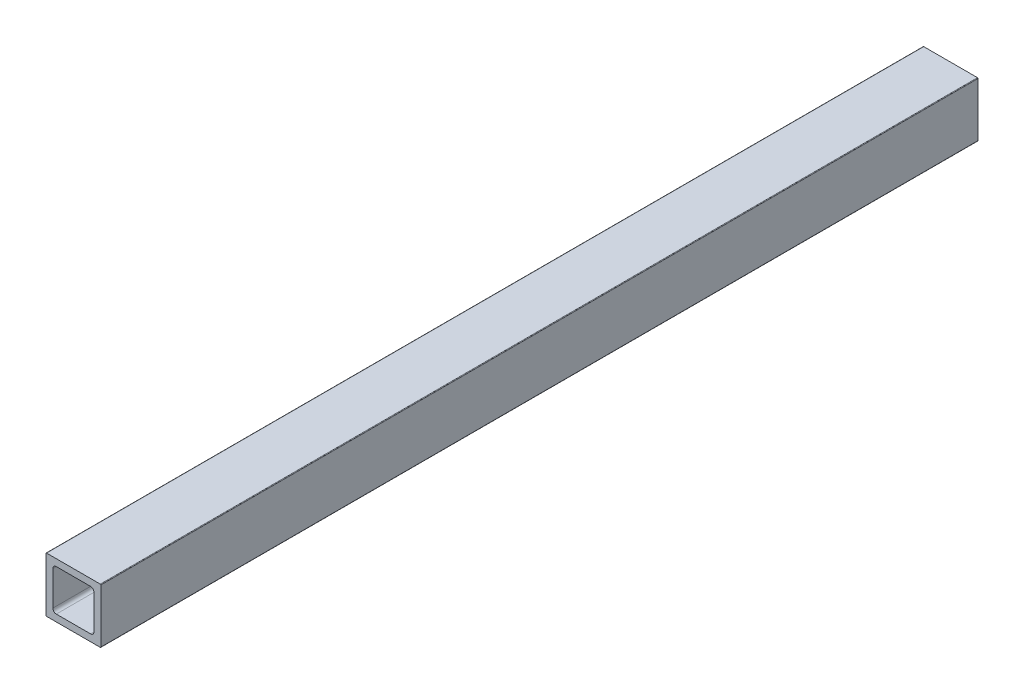
ISO-10303-21;
HEADER;
FILE_DESCRIPTION(('STEP AP214'),'2;1');
FILE_NAME('part.step','',(''),(''),'','','');
FILE_SCHEMA(('AUTOMOTIVE_DESIGN { 1 0 10303 214 1 1 1 1 }'));
ENDSEC;
DATA;
#1=APPLICATION_CONTEXT('core data for automotive mechanical design processes');
#2=APPLICATION_PROTOCOL_DEFINITION('international standard','automotive_design',2000,#1);
#3=PRODUCT_CONTEXT('',#1,'mechanical');
#4=PRODUCT('Part','Part','',(#3));
#5=PRODUCT_RELATED_PRODUCT_CATEGORY('part','',(#4));
#6=PRODUCT_DEFINITION_FORMATION('','',#4);
#7=PRODUCT_DEFINITION_CONTEXT('part definition',#1,'design');
#8=PRODUCT_DEFINITION('design','',#6,#7);
#9=PRODUCT_DEFINITION_SHAPE('','',#8);
#10=(LENGTH_UNIT() NAMED_UNIT(*) SI_UNIT(.MILLI.,.METRE.));
#11=(NAMED_UNIT(*) PLANE_ANGLE_UNIT() SI_UNIT($,.RADIAN.));
#12=(NAMED_UNIT(*) SI_UNIT($,.STERADIAN.) SOLID_ANGLE_UNIT());
#13=UNCERTAINTY_MEASURE_WITH_UNIT(LENGTH_MEASURE(1.E-05),#10,'distance_accuracy_value','');
#14=(GEOMETRIC_REPRESENTATION_CONTEXT(3) GLOBAL_UNCERTAINTY_ASSIGNED_CONTEXT((#13)) GLOBAL_UNIT_ASSIGNED_CONTEXT((#10,
#11,#12)) REPRESENTATION_CONTEXT('',''));
#15=CARTESIAN_POINT('',(0.,0.,0.));
#16=DIRECTION('',(0.,0.,1.));
#17=DIRECTION('',(1.,0.,0.));
#18=AXIS2_PLACEMENT_3D('',#15,#16,#17);
#19=CARTESIAN_POINT('',(3.175,4.7625,1828.8));
#20=DIRECTION('',(1.,0.,0.));
#21=DIRECTION('',(0.,1.,0.));
#22=AXIS2_PLACEMENT_3D('',#19,#20,#21);
#23=PLANE('',#22);
#24=DIRECTION('',(0.,-1.,0.));
#25=VECTOR('',#24,1.);
#26=CARTESIAN_POINT('',(3.175,4.7625,1422.4));
#27=LINE('',#26,#25);
#28=CARTESIAN_POINT('',(3.175,20.6375,1422.4));
#29=VERTEX_POINT('',#28);
#30=CARTESIAN_POINT('',(3.175,4.7625,1422.4));
#31=VERTEX_POINT('',#30);
#32=EDGE_CURVE('E55',#29,#31,#27,.T.);
#33=ORIENTED_EDGE('',*,*,#32,.F.);
#34=DIRECTION('',(0.,0.,-1.));
#35=VECTOR('',#34,1.);
#36=CARTESIAN_POINT('',(3.175,20.6375,1828.8));
#37=LINE('',#36,#35);
#38=CARTESIAN_POINT('',(3.175,20.6375,1828.8));
#39=VERTEX_POINT('',#38);
#40=EDGE_CURVE('E48',#39,#29,#37,.T.);
#41=ORIENTED_EDGE('',*,*,#40,.F.);
#42=DIRECTION('',(0.,-1.,0.));
#43=VECTOR('',#42,1.);
#44=CARTESIAN_POINT('',(3.175,4.7625,1828.8));
#45=LINE('',#44,#43);
#46=CARTESIAN_POINT('',(3.175,4.7625,1828.8));
#47=VERTEX_POINT('',#46);
#48=EDGE_CURVE('E214',#39,#47,#45,.T.);
#49=ORIENTED_EDGE('',*,*,#48,.T.);
#50=DIRECTION('',(0.,0.,-1.));
#51=VECTOR('',#50,1.);
#52=CARTESIAN_POINT('',(3.175,4.7625,1828.8));
#53=LINE('',#52,#51);
#54=EDGE_CURVE('E319',#47,#31,#53,.T.);
#55=ORIENTED_EDGE('',*,*,#54,.T.);
#56=EDGE_LOOP('',(#33,#41,#49,#55));
#57=FACE_BOUND('',#56,.T.);
#58=ADVANCED_FACE('F40',(#57),#23,.T.);
#59=CARTESIAN_POINT('',(4.7625,20.6375,1828.8));
#60=DIRECTION('',(0.,0.,-1.));
#61=DIRECTION('',(-1.,0.,0.));
#62=AXIS2_PLACEMENT_3D('',#59,#60,#61);
#63=CYLINDRICAL_SURFACE('',#62,1.5875);
#64=ORIENTED_EDGE('',*,*,#40,.T.);
#65=CARTESIAN_POINT('',(4.7625,20.6375,1422.4));
#66=DIRECTION('',(0.,0.,1.));
#67=DIRECTION('',(1.,0.,0.));
#68=AXIS2_PLACEMENT_3D('',#65,#66,#67);
#69=CIRCLE('',#68,1.5875);
#70=CARTESIAN_POINT('',(4.7625,22.225,1422.4));
#71=VERTEX_POINT('',#70);
#72=EDGE_CURVE('E299',#29,#71,#69,.F.);
#73=ORIENTED_EDGE('',*,*,#72,.T.);
#74=DIRECTION('',(0.,0.,-1.));
#75=VECTOR('',#74,1.);
#76=CARTESIAN_POINT('',(4.7625,22.225,1828.8));
#77=LINE('',#76,#75);
#78=CARTESIAN_POINT('',(4.7625,22.225,1828.8));
#79=VERTEX_POINT('',#78);
#80=EDGE_CURVE('E287',#79,#71,#77,.T.);
#81=ORIENTED_EDGE('',*,*,#80,.F.);
#82=CARTESIAN_POINT('',(4.7625,20.6375,1828.8));
#83=DIRECTION('',(0.,0.,1.));
#84=DIRECTION('',(-1.,0.,0.));
#85=AXIS2_PLACEMENT_3D('',#82,#83,#84);
#86=CIRCLE('',#85,1.5875);
#87=EDGE_CURVE('E219',#79,#39,#86,.T.);
#88=ORIENTED_EDGE('',*,*,#87,.T.);
#89=EDGE_LOOP('',(#64,#73,#81,#88));
#90=FACE_BOUND('',#89,.T.);
#91=ADVANCED_FACE('F297',(#90),#63,.F.);
#92=CARTESIAN_POINT('',(4.7625,22.225,1828.8));
#93=DIRECTION('',(0.,-1.,0.));
#94=DIRECTION('',(0.,0.,-1.));
#95=AXIS2_PLACEMENT_3D('',#92,#93,#94);
#96=PLANE('',#95);
#97=DIRECTION('',(-1.,0.,0.));
#98=VECTOR('',#97,1.);
#99=CARTESIAN_POINT('',(4.7625,22.225,1422.4));
#100=LINE('',#99,#98);
#101=CARTESIAN_POINT('',(20.6375,22.225,1422.4));
#102=VERTEX_POINT('',#101);
#103=EDGE_CURVE('E332',#102,#71,#100,.T.);
#104=ORIENTED_EDGE('',*,*,#103,.F.);
#105=DIRECTION('',(0.,0.,-1.));
#106=VECTOR('',#105,1.);
#107=CARTESIAN_POINT('',(20.6375,22.225,1828.8));
#108=LINE('',#107,#106);
#109=CARTESIAN_POINT('',(20.6375,22.225,1828.8));
#110=VERTEX_POINT('',#109);
#111=EDGE_CURVE('E234',#110,#102,#108,.T.);
#112=ORIENTED_EDGE('',*,*,#111,.F.);
#113=DIRECTION('',(-1.,0.,0.));
#114=VECTOR('',#113,1.);
#115=CARTESIAN_POINT('',(4.7625,22.225,1828.8));
#116=LINE('',#115,#114);
#117=EDGE_CURVE('E223',#110,#79,#116,.T.);
#118=ORIENTED_EDGE('',*,*,#117,.T.);
#119=ORIENTED_EDGE('',*,*,#80,.T.);
#120=EDGE_LOOP('',(#104,#112,#118,#119));
#121=FACE_BOUND('',#120,.T.);
#122=ADVANCED_FACE('F286',(#121),#96,.T.);
#123=CARTESIAN_POINT('',(20.6375,20.6375,1828.8));
#124=DIRECTION('',(0.,0.,-1.));
#125=DIRECTION('',(-1.,0.,0.));
#126=AXIS2_PLACEMENT_3D('',#123,#124,#125);
#127=CYLINDRICAL_SURFACE('',#126,1.5875);
#128=ORIENTED_EDGE('',*,*,#111,.T.);
#129=CARTESIAN_POINT('',(20.6375,20.6375,1422.4));
#130=DIRECTION('',(0.,0.,1.));
#131=DIRECTION('',(1.,0.,0.));
#132=AXIS2_PLACEMENT_3D('',#129,#130,#131);
#133=CIRCLE('',#132,1.5875);
#134=CARTESIAN_POINT('',(22.225,20.6375,1422.4));
#135=VERTEX_POINT('',#134);
#136=EDGE_CURVE('E334',#102,#135,#133,.F.);
#137=ORIENTED_EDGE('',*,*,#136,.T.);
#138=DIRECTION('',(0.,0.,-1.));
#139=VECTOR('',#138,1.);
#140=CARTESIAN_POINT('',(22.225,20.6375,1828.8));
#141=LINE('',#140,#139);
#142=CARTESIAN_POINT('',(22.225,20.6375,1828.8));
#143=VERTEX_POINT('',#142);
#144=EDGE_CURVE('E230',#143,#135,#141,.T.);
#145=ORIENTED_EDGE('',*,*,#144,.F.);
#146=CARTESIAN_POINT('',(20.6375,20.6375,1828.8));
#147=DIRECTION('',(0.,0.,1.));
#148=DIRECTION('',(-1.,0.,0.));
#149=AXIS2_PLACEMENT_3D('',#146,#147,#148);
#150=CIRCLE('',#149,1.5875);
#151=EDGE_CURVE('E209',#143,#110,#150,.T.);
#152=ORIENTED_EDGE('',*,*,#151,.T.);
#153=EDGE_LOOP('',(#128,#137,#145,#152));
#154=FACE_BOUND('',#153,.T.);
#155=ADVANCED_FACE('F489',(#154),#127,.F.);
#156=CARTESIAN_POINT('',(22.225,4.7625,1828.8));
#157=DIRECTION('',(-1.,0.,0.));
#158=DIRECTION('',(0.,0.,1.));
#159=AXIS2_PLACEMENT_3D('',#156,#157,#158);
#160=PLANE('',#159);
#161=DIRECTION('',(0.,1.,0.));
#162=VECTOR('',#161,1.);
#163=CARTESIAN_POINT('',(22.225,4.7625,1422.4));
#164=LINE('',#163,#162);
#165=CARTESIAN_POINT('',(22.225,4.7625,1422.4));
#166=VERTEX_POINT('',#165);
#167=EDGE_CURVE('E337',#166,#135,#164,.T.);
#168=ORIENTED_EDGE('',*,*,#167,.F.);
#169=DIRECTION('',(0.,0.,-1.));
#170=VECTOR('',#169,1.);
#171=CARTESIAN_POINT('',(22.225,4.7625,1828.8));
#172=LINE('',#171,#170);
#173=CARTESIAN_POINT('',(22.225,4.7625,1828.8));
#174=VERTEX_POINT('',#173);
#175=EDGE_CURVE('E235',#174,#166,#172,.T.);
#176=ORIENTED_EDGE('',*,*,#175,.F.);
#177=DIRECTION('',(0.,1.,0.));
#178=VECTOR('',#177,1.);
#179=CARTESIAN_POINT('',(22.225,4.7625,1828.8));
#180=LINE('',#179,#178);
#181=EDGE_CURVE('E205',#174,#143,#180,.T.);
#182=ORIENTED_EDGE('',*,*,#181,.T.);
#183=ORIENTED_EDGE('',*,*,#144,.T.);
#184=EDGE_LOOP('',(#168,#176,#182,#183));
#185=FACE_BOUND('',#184,.T.);
#186=ADVANCED_FACE('F388',(#185),#160,.T.);
#187=CARTESIAN_POINT('',(20.6375,4.7625,1828.8));
#188=DIRECTION('',(0.,0.,-1.));
#189=DIRECTION('',(-1.,0.,0.));
#190=AXIS2_PLACEMENT_3D('',#187,#188,#189);
#191=CYLINDRICAL_SURFACE('',#190,1.5875);
#192=ORIENTED_EDGE('',*,*,#175,.T.);
#193=CARTESIAN_POINT('',(20.6375,4.7625,1422.4));
#194=DIRECTION('',(0.,0.,1.));
#195=DIRECTION('',(1.,0.,0.));
#196=AXIS2_PLACEMENT_3D('',#193,#194,#195);
#197=CIRCLE('',#196,1.5875);
#198=CARTESIAN_POINT('',(20.6375,3.175,1422.4));
#199=VERTEX_POINT('',#198);
#200=EDGE_CURVE('E339',#166,#199,#197,.F.);
#201=ORIENTED_EDGE('',*,*,#200,.T.);
#202=DIRECTION('',(0.,0.,-1.));
#203=VECTOR('',#202,1.);
#204=CARTESIAN_POINT('',(20.6375,3.175,1828.8));
#205=LINE('',#204,#203);
#206=CARTESIAN_POINT('',(20.6375,3.175,1828.8));
#207=VERTEX_POINT('',#206);
#208=EDGE_CURVE('E261',#207,#199,#205,.T.);
#209=ORIENTED_EDGE('',*,*,#208,.F.);
#210=CARTESIAN_POINT('',(20.6375,4.7625,1828.8));
#211=DIRECTION('',(0.,0.,1.));
#212=DIRECTION('',(-1.,0.,0.));
#213=AXIS2_PLACEMENT_3D('',#210,#211,#212);
#214=CIRCLE('',#213,1.5875);
#215=EDGE_CURVE('E208',#207,#174,#214,.T.);
#216=ORIENTED_EDGE('',*,*,#215,.T.);
#217=EDGE_LOOP('',(#192,#201,#209,#216));
#218=FACE_BOUND('',#217,.T.);
#219=ADVANCED_FACE('F385',(#218),#191,.F.);
#220=CARTESIAN_POINT('',(4.7625,3.175,1828.8));
#221=DIRECTION('',(0.,1.,0.));
#222=DIRECTION('',(1.,0.,0.));
#223=AXIS2_PLACEMENT_3D('',#220,#221,#222);
#224=PLANE('',#223);
#225=DIRECTION('',(1.,0.,0.));
#226=VECTOR('',#225,1.);
#227=CARTESIAN_POINT('',(4.7625,3.175,1422.4));
#228=LINE('',#227,#226);
#229=CARTESIAN_POINT('',(4.7625,3.175,1422.4));
#230=VERTEX_POINT('',#229);
#231=EDGE_CURVE('E342',#230,#199,#228,.T.);
#232=ORIENTED_EDGE('',*,*,#231,.F.);
#233=DIRECTION('',(0.,0.,-1.));
#234=VECTOR('',#233,1.);
#235=CARTESIAN_POINT('',(4.7625,3.175,1828.8));
#236=LINE('',#235,#234);
#237=CARTESIAN_POINT('',(4.7625,3.175,1828.8));
#238=VERTEX_POINT('',#237);
#239=EDGE_CURVE('E265',#238,#230,#236,.T.);
#240=ORIENTED_EDGE('',*,*,#239,.F.);
#241=DIRECTION('',(1.,0.,0.));
#242=VECTOR('',#241,1.);
#243=CARTESIAN_POINT('',(4.7625,3.175,1828.8));
#244=LINE('',#243,#242);
#245=EDGE_CURVE('E251',#238,#207,#244,.T.);
#246=ORIENTED_EDGE('',*,*,#245,.T.);
#247=ORIENTED_EDGE('',*,*,#208,.T.);
#248=EDGE_LOOP('',(#232,#240,#246,#247));
#249=FACE_BOUND('',#248,.T.);
#250=ADVANCED_FACE('F387',(#249),#224,.T.);
#251=CARTESIAN_POINT('',(4.7625,4.7625,1828.8));
#252=DIRECTION('',(0.,0.,-1.));
#253=DIRECTION('',(-1.,0.,0.));
#254=AXIS2_PLACEMENT_3D('',#251,#252,#253);
#255=CYLINDRICAL_SURFACE('',#254,1.5875);
#256=ORIENTED_EDGE('',*,*,#239,.T.);
#257=CARTESIAN_POINT('',(4.7625,4.7625,1422.4));
#258=DIRECTION('',(0.,0.,1.));
#259=DIRECTION('',(1.,0.,0.));
#260=AXIS2_PLACEMENT_3D('',#257,#258,#259);
#261=CIRCLE('',#260,1.5875);
#262=EDGE_CURVE('E344',#230,#31,#261,.F.);
#263=ORIENTED_EDGE('',*,*,#262,.T.);
#264=ORIENTED_EDGE('',*,*,#54,.F.);
#265=CARTESIAN_POINT('',(4.7625,4.7625,1828.8));
#266=DIRECTION('',(0.,0.,1.));
#267=DIRECTION('',(1.,0.,0.));
#268=AXIS2_PLACEMENT_3D('',#265,#266,#267);
#269=CIRCLE('',#268,1.5875);
#270=EDGE_CURVE('E210',#47,#238,#269,.T.);
#271=ORIENTED_EDGE('',*,*,#270,.T.);
#272=EDGE_LOOP('',(#256,#263,#264,#271));
#273=FACE_BOUND('',#272,.T.);
#274=ADVANCED_FACE('F423',(#273),#255,.F.);
#275=CARTESIAN_POINT('',(0.,0.254,1828.8));
#276=DIRECTION('',(1.,0.,0.));
#277=DIRECTION('',(0.,1.,0.));
#278=AXIS2_PLACEMENT_3D('',#275,#276,#277);
#279=PLANE('',#278);
#280=DIRECTION('',(0.,0.,-1.));
#281=VECTOR('',#280,1.);
#282=CARTESIAN_POINT('',(0.,25.146,1828.8));
#283=LINE('',#282,#281);
#284=CARTESIAN_POINT('',(0.,25.146,1828.8));
#285=VERTEX_POINT('',#284);
#286=CARTESIAN_POINT('',(0.,25.146,1422.4));
#287=VERTEX_POINT('',#286);
#288=EDGE_CURVE('E260',#285,#287,#283,.T.);
#289=ORIENTED_EDGE('',*,*,#288,.T.);
#290=DIRECTION('',(0.,-1.,0.));
#291=VECTOR('',#290,1.);
#292=CARTESIAN_POINT('',(0.,0.254,1422.4));
#293=LINE('',#292,#291);
#294=CARTESIAN_POINT('',(0.,0.254,1422.4));
#295=VERTEX_POINT('',#294);
#296=EDGE_CURVE('E182',#287,#295,#293,.T.);
#297=ORIENTED_EDGE('',*,*,#296,.T.);
#298=DIRECTION('',(0.,0.,-1.));
#299=VECTOR('',#298,1.);
#300=CARTESIAN_POINT('',(0.,0.254,1828.8));
#301=LINE('',#300,#299);
#302=CARTESIAN_POINT('',(0.,0.254,1828.8));
#303=VERTEX_POINT('',#302);
#304=EDGE_CURVE('E191',#303,#295,#301,.T.);
#305=ORIENTED_EDGE('',*,*,#304,.F.);
#306=DIRECTION('',(0.,-1.,0.));
#307=VECTOR('',#306,1.);
#308=CARTESIAN_POINT('',(0.,0.254,1828.8));
#309=LINE('',#308,#307);
#310=EDGE_CURVE('E215',#285,#303,#309,.T.);
#311=ORIENTED_EDGE('',*,*,#310,.F.);
#312=EDGE_LOOP('',(#289,#297,#305,#311));
#313=FACE_BOUND('',#312,.T.);
#314=ADVANCED_FACE('F417',(#313),#279,.F.);
#315=CARTESIAN_POINT('',(0.254,25.146,1828.8));
#316=DIRECTION('',(0.,0.,-1.));
#317=DIRECTION('',(-1.,0.,0.));
#318=AXIS2_PLACEMENT_3D('',#315,#316,#317);
#319=CYLINDRICAL_SURFACE('',#318,0.254);
#320=CARTESIAN_POINT('',(0.254,25.146,1422.4));
#321=DIRECTION('',(0.,0.,1.));
#322=DIRECTION('',(1.,0.,0.));
#323=AXIS2_PLACEMENT_3D('',#320,#321,#322);
#324=CIRCLE('',#323,0.254);
#325=CARTESIAN_POINT('',(0.254000000000004,25.4,1422.4));
#326=VERTEX_POINT('',#325);
#327=EDGE_CURVE('E173',#287,#326,#324,.F.);
#328=ORIENTED_EDGE('',*,*,#327,.F.);
#329=ORIENTED_EDGE('',*,*,#288,.F.);
#330=CARTESIAN_POINT('',(0.254,25.146,1828.8));
#331=DIRECTION('',(0.,0.,1.));
#332=DIRECTION('',(-1.,0.,0.));
#333=AXIS2_PLACEMENT_3D('',#330,#331,#332);
#334=CIRCLE('',#333,0.254);
#335=CARTESIAN_POINT('',(0.254,25.4,1828.8));
#336=VERTEX_POINT('',#335);
#337=EDGE_CURVE('E236',#336,#285,#334,.T.);
#338=ORIENTED_EDGE('',*,*,#337,.F.);
#339=DIRECTION('',(0.,0.,-1.));
#340=VECTOR('',#339,1.);
#341=CARTESIAN_POINT('',(0.254,25.4,1828.8));
#342=LINE('',#341,#340);
#343=EDGE_CURVE('E256',#336,#326,#342,.T.);
#344=ORIENTED_EDGE('',*,*,#343,.T.);
#345=EDGE_LOOP('',(#328,#329,#338,#344));
#346=FACE_BOUND('',#345,.T.);
#347=ADVANCED_FACE('F422',(#346),#319,.T.);
#348=CARTESIAN_POINT('',(0.254,25.4,1828.8));
#349=DIRECTION('',(0.,-1.,0.));
#350=DIRECTION('',(0.,0.,-1.));
#351=AXIS2_PLACEMENT_3D('',#348,#349,#350);
#352=PLANE('',#351);
#353=DIRECTION('',(0.,0.,-1.));
#354=VECTOR('',#353,1.);
#355=CARTESIAN_POINT('',(25.146,25.4,1828.8));
#356=LINE('',#355,#354);
#357=CARTESIAN_POINT('',(25.146,25.4,1828.8));
#358=VERTEX_POINT('',#357);
#359=CARTESIAN_POINT('',(25.146,25.4,1422.4));
#360=VERTEX_POINT('',#359);
#361=EDGE_CURVE('E252',#358,#360,#356,.T.);
#362=ORIENTED_EDGE('',*,*,#361,.T.);
#363=DIRECTION('',(1.,0.,0.));
#364=VECTOR('',#363,1.);
#365=CARTESIAN_POINT('',(-135.222379220066,25.4,1422.4));
#366=LINE('',#365,#364);
#367=EDGE_CURVE('E183',#326,#360,#366,.T.);
#368=ORIENTED_EDGE('',*,*,#367,.F.);
#369=ORIENTED_EDGE('',*,*,#343,.F.);
#370=DIRECTION('',(-1.,0.,0.));
#371=VECTOR('',#370,1.);
#372=CARTESIAN_POINT('',(0.254,25.4,1828.8));
#373=LINE('',#372,#371);
#374=EDGE_CURVE('E228',#358,#336,#373,.T.);
#375=ORIENTED_EDGE('',*,*,#374,.F.);
#376=EDGE_LOOP('',(#362,#368,#369,#375));
#377=FACE_BOUND('',#376,.T.);
#378=ADVANCED_FACE('F359',(#377),#352,.F.);
#379=CARTESIAN_POINT('',(25.146,25.146,1828.8));
#380=DIRECTION('',(0.,0.,-1.));
#381=DIRECTION('',(-1.,0.,0.));
#382=AXIS2_PLACEMENT_3D('',#379,#380,#381);
#383=CYLINDRICAL_SURFACE('',#382,0.254);
#384=CARTESIAN_POINT('',(25.146,25.146,1422.4));
#385=DIRECTION('',(0.,0.,1.));
#386=DIRECTION('',(1.,0.,0.));
#387=AXIS2_PLACEMENT_3D('',#384,#385,#386);
#388=CIRCLE('',#387,0.254);
#389=CARTESIAN_POINT('',(25.4,25.146,1422.4));
#390=VERTEX_POINT('',#389);
#391=EDGE_CURVE('E346',#360,#390,#388,.F.);
#392=ORIENTED_EDGE('',*,*,#391,.F.);
#393=ORIENTED_EDGE('',*,*,#361,.F.);
#394=CARTESIAN_POINT('',(25.146,25.146,1828.8));
#395=DIRECTION('',(0.,0.,1.));
#396=DIRECTION('',(-1.,0.,0.));
#397=AXIS2_PLACEMENT_3D('',#394,#395,#396);
#398=CIRCLE('',#397,0.254);
#399=CARTESIAN_POINT('',(25.4,25.146,1828.8));
#400=VERTEX_POINT('',#399);
#401=EDGE_CURVE('E224',#400,#358,#398,.T.);
#402=ORIENTED_EDGE('',*,*,#401,.F.);
#403=DIRECTION('',(0.,0.,-1.));
#404=VECTOR('',#403,1.);
#405=CARTESIAN_POINT('',(25.4,25.146,1828.8));
#406=LINE('',#405,#404);
#407=EDGE_CURVE('E197',#400,#390,#406,.T.);
#408=ORIENTED_EDGE('',*,*,#407,.T.);
#409=EDGE_LOOP('',(#392,#393,#402,#408));
#410=FACE_BOUND('',#409,.T.);
#411=ADVANCED_FACE('F42',(#410),#383,.T.);
#412=CARTESIAN_POINT('',(25.4,0.254,1828.8));
#413=DIRECTION('',(-1.,0.,0.));
#414=DIRECTION('',(0.,0.,1.));
#415=AXIS2_PLACEMENT_3D('',#412,#413,#414);
#416=PLANE('',#415);
#417=DIRECTION('',(0.,0.,-1.));
#418=VECTOR('',#417,1.);
#419=CARTESIAN_POINT('',(25.4,0.254,1828.8));
#420=LINE('',#419,#418);
#421=CARTESIAN_POINT('',(25.4,0.254,1828.8));
#422=VERTEX_POINT('',#421);
#423=CARTESIAN_POINT('',(25.4,0.254,1422.4));
#424=VERTEX_POINT('',#423);
#425=EDGE_CURVE('E190',#422,#424,#420,.T.);
#426=ORIENTED_EDGE('',*,*,#425,.T.);
#427=DIRECTION('',(0.,1.,0.));
#428=VECTOR('',#427,1.);
#429=CARTESIAN_POINT('',(25.4,0.254,1422.4));
#430=LINE('',#429,#428);
#431=EDGE_CURVE('E169',#424,#390,#430,.T.);
#432=ORIENTED_EDGE('',*,*,#431,.T.);
#433=ORIENTED_EDGE('',*,*,#407,.F.);
#434=DIRECTION('',(0.,1.,0.));
#435=VECTOR('',#434,1.);
#436=CARTESIAN_POINT('',(25.4,0.254,1828.8));
#437=LINE('',#436,#435);
#438=EDGE_CURVE('E229',#422,#400,#437,.T.);
#439=ORIENTED_EDGE('',*,*,#438,.F.);
#440=EDGE_LOOP('',(#426,#432,#433,#439));
#441=FACE_BOUND('',#440,.T.);
#442=ADVANCED_FACE('F363',(#441),#416,.F.);
#443=CARTESIAN_POINT('',(25.146,0.254,1828.8));
#444=DIRECTION('',(0.,0.,-1.));
#445=DIRECTION('',(-1.,0.,0.));
#446=AXIS2_PLACEMENT_3D('',#443,#444,#445);
#447=CYLINDRICAL_SURFACE('',#446,0.254);
#448=CARTESIAN_POINT('',(25.146,0.254,1422.4));
#449=DIRECTION('',(0.,0.,1.));
#450=DIRECTION('',(1.,0.,0.));
#451=AXIS2_PLACEMENT_3D('',#448,#449,#450);
#452=CIRCLE('',#451,0.254);
#453=CARTESIAN_POINT('',(25.146,0.,1422.4));
#454=VERTEX_POINT('',#453);
#455=EDGE_CURVE('E166',#424,#454,#452,.F.);
#456=ORIENTED_EDGE('',*,*,#455,.F.);
#457=ORIENTED_EDGE('',*,*,#425,.F.);
#458=CARTESIAN_POINT('',(25.146,0.254,1828.8));
#459=DIRECTION('',(0.,0.,1.));
#460=DIRECTION('',(1.,0.,0.));
#461=AXIS2_PLACEMENT_3D('',#458,#459,#460);
#462=CIRCLE('',#461,0.254);
#463=CARTESIAN_POINT('',(25.146,0.,1828.8));
#464=VERTEX_POINT('',#463);
#465=EDGE_CURVE('E187',#464,#422,#462,.T.);
#466=ORIENTED_EDGE('',*,*,#465,.F.);
#467=DIRECTION('',(0.,0.,-1.));
#468=VECTOR('',#467,1.);
#469=CARTESIAN_POINT('',(25.146,0.,1828.8));
#470=LINE('',#469,#468);
#471=EDGE_CURVE('E179',#464,#454,#470,.T.);
#472=ORIENTED_EDGE('',*,*,#471,.T.);
#473=EDGE_LOOP('',(#456,#457,#466,#472));
#474=FACE_BOUND('',#473,.T.);
#475=ADVANCED_FACE('F185',(#474),#447,.T.);
#476=CARTESIAN_POINT('',(0.254,0.,1828.8));
#477=DIRECTION('',(0.,1.,0.));
#478=DIRECTION('',(1.,0.,0.));
#479=AXIS2_PLACEMENT_3D('',#476,#477,#478);
#480=PLANE('',#479);
#481=DIRECTION('',(0.,0.,-1.));
#482=VECTOR('',#481,1.);
#483=CARTESIAN_POINT('',(0.254,0.,1828.8));
#484=LINE('',#483,#482);
#485=CARTESIAN_POINT('',(0.254,0.,1828.8));
#486=VERTEX_POINT('',#485);
#487=CARTESIAN_POINT('',(0.254,0.,1422.4));
#488=VERTEX_POINT('',#487);
#489=EDGE_CURVE('E181',#486,#488,#484,.T.);
#490=ORIENTED_EDGE('',*,*,#489,.T.);
#491=DIRECTION('',(-1.,0.,0.));
#492=VECTOR('',#491,1.);
#493=CARTESIAN_POINT('',(-135.222379220066,0.,1422.4));
#494=LINE('',#493,#492);
#495=EDGE_CURVE('E62',#454,#488,#494,.T.);
#496=ORIENTED_EDGE('',*,*,#495,.F.);
#497=ORIENTED_EDGE('',*,*,#471,.F.);
#498=DIRECTION('',(1.,0.,0.));
#499=VECTOR('',#498,1.);
#500=CARTESIAN_POINT('',(0.254,0.,1828.8));
#501=LINE('',#500,#499);
#502=EDGE_CURVE('E245',#486,#464,#501,.T.);
#503=ORIENTED_EDGE('',*,*,#502,.F.);
#504=EDGE_LOOP('',(#490,#496,#497,#503));
#505=FACE_BOUND('',#504,.T.);
#506=ADVANCED_FACE('F177',(#505),#480,.F.);
#507=CARTESIAN_POINT('',(0.254,0.254,1828.8));
#508=DIRECTION('',(0.,0.,-1.));
#509=DIRECTION('',(-1.,0.,0.));
#510=AXIS2_PLACEMENT_3D('',#507,#508,#509);
#511=CYLINDRICAL_SURFACE('',#510,0.254);
#512=CARTESIAN_POINT('',(0.254,0.254,1422.4));
#513=DIRECTION('',(0.,0.,1.));
#514=DIRECTION('',(1.,0.,0.));
#515=AXIS2_PLACEMENT_3D('',#512,#513,#514);
#516=CIRCLE('',#515,0.254);
#517=EDGE_CURVE('E11',#488,#295,#516,.F.);
#518=ORIENTED_EDGE('',*,*,#517,.F.);
#519=ORIENTED_EDGE('',*,*,#489,.F.);
#520=CARTESIAN_POINT('',(0.254,0.254,1828.8));
#521=DIRECTION('',(0.,0.,1.));
#522=DIRECTION('',(-1.,0.,0.));
#523=AXIS2_PLACEMENT_3D('',#520,#521,#522);
#524=CIRCLE('',#523,0.254);
#525=EDGE_CURVE('E248',#303,#486,#524,.T.);
#526=ORIENTED_EDGE('',*,*,#525,.F.);
#527=ORIENTED_EDGE('',*,*,#304,.T.);
#528=EDGE_LOOP('',(#518,#519,#526,#527));
#529=FACE_BOUND('',#528,.T.);
#530=ADVANCED_FACE('F381',(#529),#511,.T.);
#531=CARTESIAN_POINT('',(0.254,0.254,1828.8));
#532=DIRECTION('',(0.,0.,-1.));
#533=DIRECTION('',(0.,-1.,0.));
#534=AXIS2_PLACEMENT_3D('',#531,#532,#533);
#535=PLANE('',#534);
#536=ORIENTED_EDGE('',*,*,#270,.F.);
#537=ORIENTED_EDGE('',*,*,#48,.F.);
#538=ORIENTED_EDGE('',*,*,#87,.F.);
#539=ORIENTED_EDGE('',*,*,#117,.F.);
#540=ORIENTED_EDGE('',*,*,#151,.F.);
#541=ORIENTED_EDGE('',*,*,#181,.F.);
#542=ORIENTED_EDGE('',*,*,#215,.F.);
#543=ORIENTED_EDGE('',*,*,#245,.F.);
#544=EDGE_LOOP('',(#536,#537,#538,#539,#540,#541,#542,#543));
#545=FACE_BOUND('',#544,.T.);
#546=ORIENTED_EDGE('',*,*,#525,.T.);
#547=ORIENTED_EDGE('',*,*,#502,.T.);
#548=ORIENTED_EDGE('',*,*,#465,.T.);
#549=ORIENTED_EDGE('',*,*,#438,.T.);
#550=ORIENTED_EDGE('',*,*,#401,.T.);
#551=ORIENTED_EDGE('',*,*,#374,.T.);
#552=ORIENTED_EDGE('',*,*,#337,.T.);
#553=ORIENTED_EDGE('',*,*,#310,.T.);
#554=EDGE_LOOP('',(#546,#547,#548,#549,#550,#551,#552,#553));
#555=FACE_BOUND('',#554,.T.);
#556=ADVANCED_FACE('F293',(#545,#555),#535,.F.);
#557=CARTESIAN_POINT('',(-135.222379220066,-1447.8625494804,1422.4));
#558=DIRECTION('',(0.,0.,1.));
#559=DIRECTION('',(1.,0.,0.));
#560=AXIS2_PLACEMENT_3D('',#557,#558,#559);
#561=PLANE('',#560);
#562=ORIENTED_EDGE('',*,*,#32,.T.);
#563=ORIENTED_EDGE('',*,*,#262,.F.);
#564=ORIENTED_EDGE('',*,*,#231,.T.);
#565=ORIENTED_EDGE('',*,*,#200,.F.);
#566=ORIENTED_EDGE('',*,*,#167,.T.);
#567=ORIENTED_EDGE('',*,*,#136,.F.);
#568=ORIENTED_EDGE('',*,*,#103,.T.);
#569=ORIENTED_EDGE('',*,*,#72,.F.);
#570=EDGE_LOOP('',(#562,#563,#564,#565,#566,#567,#568,#569));
#571=FACE_BOUND('',#570,.T.);
#572=ORIENTED_EDGE('',*,*,#391,.T.);
#573=ORIENTED_EDGE('',*,*,#431,.F.);
#574=ORIENTED_EDGE('',*,*,#455,.T.);
#575=ORIENTED_EDGE('',*,*,#495,.T.);
#576=ORIENTED_EDGE('',*,*,#517,.T.);
#577=ORIENTED_EDGE('',*,*,#296,.F.);
#578=ORIENTED_EDGE('',*,*,#327,.T.);
#579=ORIENTED_EDGE('',*,*,#367,.T.);
#580=EDGE_LOOP('',(#572,#573,#574,#575,#576,#577,#578,#579));
#581=FACE_BOUND('',#580,.T.);
#582=ADVANCED_FACE('F167',(#571,#581),#561,.F.);
#583=CLOSED_SHELL('',(#58,#91,#122,#155,#186,#219,#250,#274,#314,#347,#378,#411,#442,#475,#506,
#530,#556,#582));
#584=MANIFOLD_SOLID_BREP('B2',#583);
#585=ADVANCED_BREP_SHAPE_REPRESENTATION('',(#18,#584),#14);
#586=SHAPE_DEFINITION_REPRESENTATION(#9,#585);
ENDSEC;
END-ISO-10303-21;
